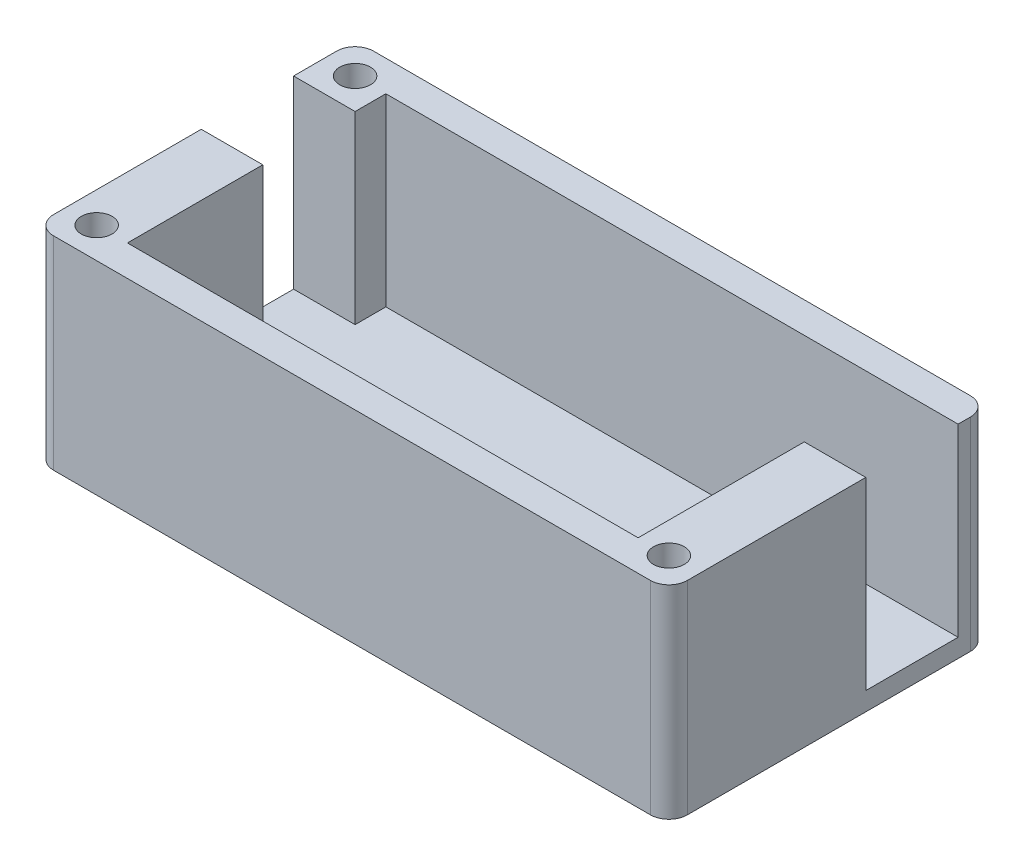
ISO-10303-21;
HEADER;
FILE_DESCRIPTION(('STEP AP214'),'2;1');
FILE_NAME('part.step','',(''),(''),'','','');
FILE_SCHEMA(('AUTOMOTIVE_DESIGN { 1 0 10303 214 1 1 1 1 }'));
ENDSEC;
DATA;
#1=APPLICATION_CONTEXT('core data for automotive mechanical design processes');
#2=APPLICATION_PROTOCOL_DEFINITION('international standard','automotive_design',2000,#1);
#3=PRODUCT_CONTEXT('',#1,'mechanical');
#4=PRODUCT('Part','Part','',(#3));
#5=PRODUCT_RELATED_PRODUCT_CATEGORY('part','',(#4));
#6=PRODUCT_DEFINITION_FORMATION('','',#4);
#7=PRODUCT_DEFINITION_CONTEXT('part definition',#1,'design');
#8=PRODUCT_DEFINITION('design','',#6,#7);
#9=PRODUCT_DEFINITION_SHAPE('','',#8);
#10=(LENGTH_UNIT() NAMED_UNIT(*) SI_UNIT(.MILLI.,.METRE.));
#11=(NAMED_UNIT(*) PLANE_ANGLE_UNIT() SI_UNIT($,.RADIAN.));
#12=(NAMED_UNIT(*) SI_UNIT($,.STERADIAN.) SOLID_ANGLE_UNIT());
#13=UNCERTAINTY_MEASURE_WITH_UNIT(LENGTH_MEASURE(1.E-05),#10,'distance_accuracy_value','');
#14=(GEOMETRIC_REPRESENTATION_CONTEXT(3) GLOBAL_UNCERTAINTY_ASSIGNED_CONTEXT((#13)) GLOBAL_UNIT_ASSIGNED_CONTEXT((#10,
#11,#12)) REPRESENTATION_CONTEXT('',''));
#15=CARTESIAN_POINT('',(0.,0.,0.));
#16=DIRECTION('',(0.,0.,1.));
#17=DIRECTION('',(1.,0.,0.));
#18=AXIS2_PLACEMENT_3D('',#15,#16,#17);
#19=CARTESIAN_POINT('',(0.,30.,0.));
#20=DIRECTION('',(0.,-1.,0.));
#21=DIRECTION('',(0.,0.,-1.));
#22=AXIS2_PLACEMENT_3D('',#19,#20,#21);
#23=PLANE('',#22);
#24=CARTESIAN_POINT('',(46.5,30.,21.));
#25=DIRECTION('',(0.,1.,0.));
#26=DIRECTION('',(0.,0.,1.));
#27=AXIS2_PLACEMENT_3D('',#24,#25,#26);
#28=CIRCLE('',#27,2.49999999999999);
#29=CARTESIAN_POINT('',(46.5,30.,23.5));
#30=VERTEX_POINT('',#29);
#31=EDGE_CURVE('E184',#30,#30,#28,.T.);
#32=ORIENTED_EDGE('',*,*,#31,.F.);
#33=EDGE_LOOP('',(#32));
#34=FACE_BOUND('',#33,.T.);
#35=DIRECTION('',(1.,0.,0.));
#36=VECTOR('',#35,1.);
#37=CARTESIAN_POINT('',(-51.5,30.,26.));
#38=LINE('',#37,#36);
#39=CARTESIAN_POINT('',(-48.5,30.,26.));
#40=VERTEX_POINT('',#39);
#41=CARTESIAN_POINT('',(48.5,30.,26.));
#42=VERTEX_POINT('',#41);
#43=EDGE_CURVE('E330',#40,#42,#38,.T.);
#44=ORIENTED_EDGE('',*,*,#43,.T.);
#45=CARTESIAN_POINT('',(48.5,30.,23.));
#46=DIRECTION('',(0.,-1.,0.));
#47=DIRECTION('',(0.,0.,-1.));
#48=AXIS2_PLACEMENT_3D('',#45,#46,#47);
#49=CIRCLE('',#48,3.);
#50=CARTESIAN_POINT('',(51.5,30.,23.));
#51=VERTEX_POINT('',#50);
#52=EDGE_CURVE('E374',#42,#51,#49,.F.);
#53=ORIENTED_EDGE('',*,*,#52,.T.);
#54=DIRECTION('',(0.,0.,-1.));
#55=VECTOR('',#54,1.);
#56=CARTESIAN_POINT('',(51.5,30.,26.));
#57=LINE('',#56,#55);
#58=CARTESIAN_POINT('',(51.5,30.,-6.));
#59=VERTEX_POINT('',#58);
#60=EDGE_CURVE('E319',#51,#59,#57,.T.);
#61=ORIENTED_EDGE('',*,*,#60,.T.);
#62=DIRECTION('',(1.,0.,0.));
#63=VECTOR('',#62,1.);
#64=CARTESIAN_POINT('',(41.5,30.,-6.));
#65=LINE('',#64,#63);
#66=CARTESIAN_POINT('',(41.5,30.,-6.));
#67=VERTEX_POINT('',#66);
#68=EDGE_CURVE('E213',#67,#59,#65,.T.);
#69=ORIENTED_EDGE('',*,*,#68,.F.);
#70=DIRECTION('',(0.,0.,-1.));
#71=VECTOR('',#70,1.);
#72=CARTESIAN_POINT('',(41.5,30.,21.));
#73=LINE('',#72,#71);
#74=CARTESIAN_POINT('',(41.5,30.,21.));
#75=VERTEX_POINT('',#74);
#76=EDGE_CURVE('E276',#75,#67,#73,.T.);
#77=ORIENTED_EDGE('',*,*,#76,.F.);
#78=DIRECTION('',(1.,0.,0.));
#79=VECTOR('',#78,1.);
#80=CARTESIAN_POINT('',(-41.5,30.,21.));
#81=LINE('',#80,#79);
#82=CARTESIAN_POINT('',(-41.5,30.,21.));
#83=VERTEX_POINT('',#82);
#84=EDGE_CURVE('E289',#83,#75,#81,.T.);
#85=ORIENTED_EDGE('',*,*,#84,.F.);
#86=DIRECTION('',(0.,0.,1.));
#87=VECTOR('',#86,1.);
#88=CARTESIAN_POINT('',(-41.5,30.,21.));
#89=LINE('',#88,#87);
#90=CARTESIAN_POINT('',(-41.5,30.,-1.));
#91=VERTEX_POINT('',#90);
#92=EDGE_CURVE('E284',#91,#83,#89,.T.);
#93=ORIENTED_EDGE('',*,*,#92,.F.);
#94=DIRECTION('',(1.,0.,0.));
#95=VECTOR('',#94,1.);
#96=CARTESIAN_POINT('',(-41.5,30.,-1.));
#97=LINE('',#96,#95);
#98=CARTESIAN_POINT('',(-51.5,30.,-1.));
#99=VERTEX_POINT('',#98);
#100=EDGE_CURVE('E242',#99,#91,#97,.T.);
#101=ORIENTED_EDGE('',*,*,#100,.F.);
#102=DIRECTION('',(0.,0.,1.));
#103=VECTOR('',#102,1.);
#104=CARTESIAN_POINT('',(-51.5,30.,26.));
#105=LINE('',#104,#103);
#106=CARTESIAN_POINT('',(-51.5,30.,23.));
#107=VERTEX_POINT('',#106);
#108=EDGE_CURVE('E326',#99,#107,#105,.T.);
#109=ORIENTED_EDGE('',*,*,#108,.T.);
#110=CARTESIAN_POINT('',(-48.5,30.,23.));
#111=DIRECTION('',(0.,-1.,0.));
#112=DIRECTION('',(0.,0.,-1.));
#113=AXIS2_PLACEMENT_3D('',#110,#111,#112);
#114=CIRCLE('',#113,3.);
#115=EDGE_CURVE('E371',#107,#40,#114,.F.);
#116=ORIENTED_EDGE('',*,*,#115,.T.);
#117=EDGE_LOOP('',(#44,#53,#61,#69,#77,#85,#93,#101,#109,#116));
#118=FACE_BOUND('',#117,.T.);
#119=CARTESIAN_POINT('',(-46.5,30.,21.));
#120=DIRECTION('',(0.,1.,0.));
#121=DIRECTION('',(0.,0.,1.));
#122=AXIS2_PLACEMENT_3D('',#119,#120,#121);
#123=CIRCLE('',#122,2.49999999999999);
#124=CARTESIAN_POINT('',(-46.5,30.,23.5));
#125=VERTEX_POINT('',#124);
#126=EDGE_CURVE('E198',#125,#125,#123,.T.);
#127=ORIENTED_EDGE('',*,*,#126,.F.);
#128=EDGE_LOOP('',(#127));
#129=FACE_BOUND('',#128,.T.);
#130=ADVANCED_FACE('F38',(#34,#118,#129),#23,.F.);
#131=CARTESIAN_POINT('',(-46.5,30.,-21.));
#132=DIRECTION('',(0.,1.,0.));
#133=DIRECTION('',(0.,0.,1.));
#134=AXIS2_PLACEMENT_3D('',#131,#132,#133);
#135=CIRCLE('',#134,2.49999999999999);
#136=CARTESIAN_POINT('',(-46.5,30.,-18.5));
#137=VERTEX_POINT('',#136);
#138=EDGE_CURVE('E185',#137,#137,#135,.T.);
#139=ORIENTED_EDGE('',*,*,#138,.F.);
#140=EDGE_LOOP('',(#139));
#141=FACE_BOUND('',#140,.T.);
#142=CARTESIAN_POINT('',(51.5,30.,-21.));
#143=VERTEX_POINT('',#142);
#144=CARTESIAN_POINT('',(51.5,30.,-23.));
#145=VERTEX_POINT('',#144);
#146=EDGE_CURVE('E318',#143,#145,#57,.T.);
#147=ORIENTED_EDGE('',*,*,#146,.T.);
#148=CARTESIAN_POINT('',(48.5,30.,-23.));
#149=DIRECTION('',(0.,-1.,0.));
#150=DIRECTION('',(0.,0.,-1.));
#151=AXIS2_PLACEMENT_3D('',#148,#149,#150);
#152=CIRCLE('',#151,3.);
#153=CARTESIAN_POINT('',(48.5,30.,-26.));
#154=VERTEX_POINT('',#153);
#155=EDGE_CURVE('E362',#145,#154,#152,.F.);
#156=ORIENTED_EDGE('',*,*,#155,.T.);
#157=DIRECTION('',(-1.,0.,0.));
#158=VECTOR('',#157,1.);
#159=CARTESIAN_POINT('',(-51.5,30.,-26.));
#160=LINE('',#159,#158);
#161=CARTESIAN_POINT('',(-48.5,30.,-26.));
#162=VERTEX_POINT('',#161);
#163=EDGE_CURVE('E322',#154,#162,#160,.T.);
#164=ORIENTED_EDGE('',*,*,#163,.T.);
#165=CARTESIAN_POINT('',(-48.5,30.,-23.));
#166=DIRECTION('',(0.,-1.,0.));
#167=DIRECTION('',(0.,0.,-1.));
#168=AXIS2_PLACEMENT_3D('',#165,#166,#167);
#169=CIRCLE('',#168,3.);
#170=CARTESIAN_POINT('',(-51.5,30.,-23.));
#171=VERTEX_POINT('',#170);
#172=EDGE_CURVE('E359',#162,#171,#169,.F.);
#173=ORIENTED_EDGE('',*,*,#172,.T.);
#174=CARTESIAN_POINT('',(-51.5,30.,-16.));
#175=VERTEX_POINT('',#174);
#176=EDGE_CURVE('E327',#171,#175,#105,.T.);
#177=ORIENTED_EDGE('',*,*,#176,.T.);
#178=DIRECTION('',(-1.,0.,0.));
#179=VECTOR('',#178,1.);
#180=CARTESIAN_POINT('',(-41.5,30.,-16.));
#181=LINE('',#180,#179);
#182=CARTESIAN_POINT('',(-41.5,30.,-16.));
#183=VERTEX_POINT('',#182);
#184=EDGE_CURVE('E206',#183,#175,#181,.T.);
#185=ORIENTED_EDGE('',*,*,#184,.F.);
#186=CARTESIAN_POINT('',(-41.5,30.,-21.));
#187=VERTEX_POINT('',#186);
#188=EDGE_CURVE('E285',#187,#183,#89,.T.);
#189=ORIENTED_EDGE('',*,*,#188,.F.);
#190=DIRECTION('',(-1.,0.,0.));
#191=VECTOR('',#190,1.);
#192=CARTESIAN_POINT('',(-41.5,30.,-21.));
#193=LINE('',#192,#191);
#194=EDGE_CURVE('E280',#143,#187,#193,.T.);
#195=ORIENTED_EDGE('',*,*,#194,.F.);
#196=EDGE_LOOP('',(#147,#156,#164,#173,#177,#185,#189,#195));
#197=FACE_BOUND('',#196,.T.);
#198=ADVANCED_FACE('F412',(#141,#197),#23,.F.);
#199=CARTESIAN_POINT('',(-41.5,30.,21.));
#200=DIRECTION('',(1.,0.,0.));
#201=DIRECTION('',(0.,0.,-1.));
#202=AXIS2_PLACEMENT_3D('',#199,#200,#201);
#203=PLANE('',#202);
#204=DIRECTION('',(0.,1.,0.));
#205=VECTOR('',#204,1.);
#206=CARTESIAN_POINT('',(-41.5,-18.0277563773199,-1.));
#207=LINE('',#206,#205);
#208=CARTESIAN_POINT('',(-41.5,0.,-0.999999999999994));
#209=VERTEX_POINT('',#208);
#210=EDGE_CURVE('E236',#209,#91,#207,.T.);
#211=ORIENTED_EDGE('',*,*,#210,.T.);
#212=ORIENTED_EDGE('',*,*,#92,.T.);
#213=DIRECTION('',(0.,-1.,0.));
#214=VECTOR('',#213,1.);
#215=CARTESIAN_POINT('',(-41.5,30.,21.));
#216=LINE('',#215,#214);
#217=CARTESIAN_POINT('',(-41.5,0.,21.));
#218=VERTEX_POINT('',#217);
#219=EDGE_CURVE('E311',#83,#218,#216,.T.);
#220=ORIENTED_EDGE('',*,*,#219,.T.);
#221=DIRECTION('',(0.,0.,1.));
#222=VECTOR('',#221,1.);
#223=CARTESIAN_POINT('',(-41.5,0.,21.));
#224=LINE('',#223,#222);
#225=EDGE_CURVE('E300',#209,#218,#224,.T.);
#226=ORIENTED_EDGE('',*,*,#225,.F.);
#227=EDGE_LOOP('',(#211,#212,#220,#226));
#228=FACE_BOUND('',#227,.T.);
#229=ADVANCED_FACE('F424',(#228),#203,.T.);
#230=CARTESIAN_POINT('',(51.5,30.,26.));
#231=DIRECTION('',(-1.,0.,0.));
#232=DIRECTION('',(0.,0.,1.));
#233=AXIS2_PLACEMENT_3D('',#230,#231,#232);
#234=PLANE('',#233);
#235=DIRECTION('',(0.,0.,1.));
#236=VECTOR('',#235,1.);
#237=CARTESIAN_POINT('',(51.5,-3.,26.));
#238=LINE('',#237,#236);
#239=CARTESIAN_POINT('',(51.5,-3.,-23.));
#240=VERTEX_POINT('',#239);
#241=CARTESIAN_POINT('',(51.5,-3.,23.));
#242=VERTEX_POINT('',#241);
#243=EDGE_CURVE('E271',#240,#242,#238,.T.);
#244=ORIENTED_EDGE('',*,*,#243,.F.);
#245=DIRECTION('',(0.,-1.,0.));
#246=VECTOR('',#245,1.);
#247=CARTESIAN_POINT('',(51.5,30.,-23.));
#248=LINE('',#247,#246);
#249=EDGE_CURVE('E356',#240,#145,#248,.F.);
#250=ORIENTED_EDGE('',*,*,#249,.T.);
#251=ORIENTED_EDGE('',*,*,#146,.F.);
#252=DIRECTION('',(0.,1.,0.));
#253=VECTOR('',#252,1.);
#254=CARTESIAN_POINT('',(51.5,-18.0277563773199,-21.));
#255=LINE('',#254,#253);
#256=CARTESIAN_POINT('',(51.5,0.,-21.));
#257=VERTEX_POINT('',#256);
#258=EDGE_CURVE('E212',#257,#143,#255,.T.);
#259=ORIENTED_EDGE('',*,*,#258,.F.);
#260=DIRECTION('',(0.,0.,1.));
#261=VECTOR('',#260,1.);
#262=CARTESIAN_POINT('',(51.5,0.,-21.));
#263=LINE('',#262,#261);
#264=CARTESIAN_POINT('',(51.5,0.,-6.));
#265=VERTEX_POINT('',#264);
#266=EDGE_CURVE('E207',#257,#265,#263,.T.);
#267=ORIENTED_EDGE('',*,*,#266,.T.);
#268=DIRECTION('',(0.,1.,0.));
#269=VECTOR('',#268,1.);
#270=CARTESIAN_POINT('',(51.5,-18.0277563773199,-6.));
#271=LINE('',#270,#269);
#272=EDGE_CURVE('E222',#265,#59,#271,.T.);
#273=ORIENTED_EDGE('',*,*,#272,.T.);
#274=ORIENTED_EDGE('',*,*,#60,.F.);
#275=DIRECTION('',(0.,-1.,0.));
#276=VECTOR('',#275,1.);
#277=CARTESIAN_POINT('',(51.5,30.,23.));
#278=LINE('',#277,#276);
#279=EDGE_CURVE('E352',#51,#242,#278,.T.);
#280=ORIENTED_EDGE('',*,*,#279,.T.);
#281=EDGE_LOOP('',(#244,#250,#251,#259,#267,#273,#274,#280));
#282=FACE_BOUND('',#281,.T.);
#283=ADVANCED_FACE('F400',(#282),#234,.F.);
#284=CARTESIAN_POINT('',(-51.5,30.,-26.));
#285=DIRECTION('',(0.,0.,1.));
#286=DIRECTION('',(1.,0.,0.));
#287=AXIS2_PLACEMENT_3D('',#284,#285,#286);
#288=PLANE('',#287);
#289=ORIENTED_EDGE('',*,*,#163,.F.);
#290=DIRECTION('',(0.,-1.,0.));
#291=VECTOR('',#290,1.);
#292=CARTESIAN_POINT('',(48.5,30.,-26.));
#293=LINE('',#292,#291);
#294=CARTESIAN_POINT('',(48.5,-3.,-26.));
#295=VERTEX_POINT('',#294);
#296=EDGE_CURVE('E336',#154,#295,#293,.T.);
#297=ORIENTED_EDGE('',*,*,#296,.T.);
#298=DIRECTION('',(1.,0.,0.));
#299=VECTOR('',#298,1.);
#300=CARTESIAN_POINT('',(51.5,-3.,-26.));
#301=LINE('',#300,#299);
#302=CARTESIAN_POINT('',(-48.5,-3.,-26.));
#303=VERTEX_POINT('',#302);
#304=EDGE_CURVE('E267',#303,#295,#301,.T.);
#305=ORIENTED_EDGE('',*,*,#304,.F.);
#306=DIRECTION('',(0.,-1.,0.));
#307=VECTOR('',#306,1.);
#308=CARTESIAN_POINT('',(-48.5,30.,-26.));
#309=LINE('',#308,#307);
#310=EDGE_CURVE('E333',#303,#162,#309,.F.);
#311=ORIENTED_EDGE('',*,*,#310,.T.);
#312=EDGE_LOOP('',(#289,#297,#305,#311));
#313=FACE_BOUND('',#312,.T.);
#314=ADVANCED_FACE('F408',(#313),#288,.F.);
#315=CARTESIAN_POINT('',(-51.5,30.,26.));
#316=DIRECTION('',(1.,0.,0.));
#317=DIRECTION('',(0.,0.,-1.));
#318=AXIS2_PLACEMENT_3D('',#315,#316,#317);
#319=PLANE('',#318);
#320=DIRECTION('',(0.,0.,-1.));
#321=VECTOR('',#320,1.);
#322=CARTESIAN_POINT('',(-51.5,-3.,-26.));
#323=LINE('',#322,#321);
#324=CARTESIAN_POINT('',(-51.5,-3.,23.));
#325=VERTEX_POINT('',#324);
#326=CARTESIAN_POINT('',(-51.5,-3.,-23.));
#327=VERTEX_POINT('',#326);
#328=EDGE_CURVE('E263',#325,#327,#323,.T.);
#329=ORIENTED_EDGE('',*,*,#328,.F.);
#330=DIRECTION('',(0.,-1.,0.));
#331=VECTOR('',#330,1.);
#332=CARTESIAN_POINT('',(-51.5,30.,23.));
#333=LINE('',#332,#331);
#334=EDGE_CURVE('E11',#325,#107,#333,.F.);
#335=ORIENTED_EDGE('',*,*,#334,.T.);
#336=ORIENTED_EDGE('',*,*,#108,.F.);
#337=DIRECTION('',(0.,1.,0.));
#338=VECTOR('',#337,1.);
#339=CARTESIAN_POINT('',(-51.5,-18.0277563773199,-1.));
#340=LINE('',#339,#338);
#341=CARTESIAN_POINT('',(-51.5,0.,-1.));
#342=VERTEX_POINT('',#341);
#343=EDGE_CURVE('E249',#342,#99,#340,.T.);
#344=ORIENTED_EDGE('',*,*,#343,.F.);
#345=DIRECTION('',(0.,0.,-1.));
#346=VECTOR('',#345,1.);
#347=CARTESIAN_POINT('',(-51.5,0.,-1.));
#348=LINE('',#347,#346);
#349=CARTESIAN_POINT('',(-51.5,0.,-16.));
#350=VERTEX_POINT('',#349);
#351=EDGE_CURVE('E231',#342,#350,#348,.T.);
#352=ORIENTED_EDGE('',*,*,#351,.T.);
#353=DIRECTION('',(0.,1.,0.));
#354=VECTOR('',#353,1.);
#355=CARTESIAN_POINT('',(-51.5,-18.0277563773199,-16.));
#356=LINE('',#355,#354);
#357=EDGE_CURVE('E252',#350,#175,#356,.T.);
#358=ORIENTED_EDGE('',*,*,#357,.T.);
#359=ORIENTED_EDGE('',*,*,#176,.F.);
#360=DIRECTION('',(0.,-1.,0.));
#361=VECTOR('',#360,1.);
#362=CARTESIAN_POINT('',(-51.5,30.,-23.));
#363=LINE('',#362,#361);
#364=EDGE_CURVE('E47',#171,#327,#363,.T.);
#365=ORIENTED_EDGE('',*,*,#364,.T.);
#366=EDGE_LOOP('',(#329,#335,#336,#344,#352,#358,#359,#365));
#367=FACE_BOUND('',#366,.T.);
#368=ADVANCED_FACE('F380',(#367),#319,.F.);
#369=CARTESIAN_POINT('',(-51.5,30.,26.));
#370=DIRECTION('',(0.,0.,-1.));
#371=DIRECTION('',(-1.,0.,0.));
#372=AXIS2_PLACEMENT_3D('',#369,#370,#371);
#373=PLANE('',#372);
#374=DIRECTION('',(-1.,0.,0.));
#375=VECTOR('',#374,1.);
#376=CARTESIAN_POINT('',(-51.5,-3.,26.));
#377=LINE('',#376,#375);
#378=CARTESIAN_POINT('',(48.5,-3.,26.));
#379=VERTEX_POINT('',#378);
#380=CARTESIAN_POINT('',(-48.5,-3.,26.));
#381=VERTEX_POINT('',#380);
#382=EDGE_CURVE('E230',#379,#381,#377,.T.);
#383=ORIENTED_EDGE('',*,*,#382,.F.);
#384=DIRECTION('',(0.,-1.,0.));
#385=VECTOR('',#384,1.);
#386=CARTESIAN_POINT('',(48.5,30.,26.));
#387=LINE('',#386,#385);
#388=EDGE_CURVE('E60',#379,#42,#387,.F.);
#389=ORIENTED_EDGE('',*,*,#388,.T.);
#390=ORIENTED_EDGE('',*,*,#43,.F.);
#391=DIRECTION('',(0.,-1.,0.));
#392=VECTOR('',#391,1.);
#393=CARTESIAN_POINT('',(-48.5,30.,26.));
#394=LINE('',#393,#392);
#395=EDGE_CURVE('E365',#40,#381,#394,.T.);
#396=ORIENTED_EDGE('',*,*,#395,.T.);
#397=EDGE_LOOP('',(#383,#389,#390,#396));
#398=FACE_BOUND('',#397,.T.);
#399=ADVANCED_FACE('F390',(#398),#373,.F.);
#400=CARTESIAN_POINT('',(41.5,30.,21.));
#401=DIRECTION('',(-1.,0.,0.));
#402=DIRECTION('',(0.,0.,1.));
#403=AXIS2_PLACEMENT_3D('',#400,#401,#402);
#404=PLANE('',#403);
#405=DIRECTION('',(0.,1.,0.));
#406=VECTOR('',#405,1.);
#407=CARTESIAN_POINT('',(41.5,-18.0277563773199,-6.));
#408=LINE('',#407,#406);
#409=CARTESIAN_POINT('',(41.5,0.,-6.));
#410=VERTEX_POINT('',#409);
#411=EDGE_CURVE('E217',#410,#67,#408,.T.);
#412=ORIENTED_EDGE('',*,*,#411,.F.);
#413=DIRECTION('',(0.,0.,-1.));
#414=VECTOR('',#413,1.);
#415=CARTESIAN_POINT('',(41.5,0.,21.));
#416=LINE('',#415,#414);
#417=CARTESIAN_POINT('',(41.5,0.,21.));
#418=VERTEX_POINT('',#417);
#419=EDGE_CURVE('E275',#418,#410,#416,.T.);
#420=ORIENTED_EDGE('',*,*,#419,.F.);
#421=DIRECTION('',(0.,-1.,0.));
#422=VECTOR('',#421,1.);
#423=CARTESIAN_POINT('',(41.5,30.,21.));
#424=LINE('',#423,#422);
#425=EDGE_CURVE('E292',#75,#418,#424,.T.);
#426=ORIENTED_EDGE('',*,*,#425,.F.);
#427=ORIENTED_EDGE('',*,*,#76,.T.);
#428=EDGE_LOOP('',(#412,#420,#426,#427));
#429=FACE_BOUND('',#428,.T.);
#430=ADVANCED_FACE('F429',(#429),#404,.T.);
#431=CARTESIAN_POINT('',(-41.5,30.,-21.));
#432=DIRECTION('',(0.,0.,1.));
#433=DIRECTION('',(1.,0.,0.));
#434=AXIS2_PLACEMENT_3D('',#431,#432,#433);
#435=PLANE('',#434);
#436=DIRECTION('',(-1.,0.,0.));
#437=VECTOR('',#436,1.);
#438=CARTESIAN_POINT('',(-41.5,0.,-21.));
#439=LINE('',#438,#437);
#440=CARTESIAN_POINT('',(-41.5,0.,-21.));
#441=VERTEX_POINT('',#440);
#442=EDGE_CURVE('E296',#257,#441,#439,.T.);
#443=ORIENTED_EDGE('',*,*,#442,.F.);
#444=ORIENTED_EDGE('',*,*,#258,.T.);
#445=ORIENTED_EDGE('',*,*,#194,.T.);
#446=DIRECTION('',(0.,-1.,0.));
#447=VECTOR('',#446,1.);
#448=CARTESIAN_POINT('',(-41.5,30.,-21.));
#449=LINE('',#448,#447);
#450=EDGE_CURVE('E315',#187,#441,#449,.T.);
#451=ORIENTED_EDGE('',*,*,#450,.T.);
#452=EDGE_LOOP('',(#443,#444,#445,#451));
#453=FACE_BOUND('',#452,.T.);
#454=ADVANCED_FACE('F559',(#453),#435,.T.);
#455=DIRECTION('',(0.,1.,0.));
#456=VECTOR('',#455,1.);
#457=CARTESIAN_POINT('',(-41.5,-18.0277563773199,-16.));
#458=LINE('',#457,#456);
#459=CARTESIAN_POINT('',(-41.5,0.,-16.));
#460=VERTEX_POINT('',#459);
#461=EDGE_CURVE('E245',#460,#183,#458,.T.);
#462=ORIENTED_EDGE('',*,*,#461,.F.);
#463=EDGE_CURVE('E301',#441,#460,#224,.T.);
#464=ORIENTED_EDGE('',*,*,#463,.F.);
#465=ORIENTED_EDGE('',*,*,#450,.F.);
#466=ORIENTED_EDGE('',*,*,#188,.T.);
#467=EDGE_LOOP('',(#462,#464,#465,#466));
#468=FACE_BOUND('',#467,.T.);
#469=ADVANCED_FACE('F566',(#468),#203,.T.);
#470=CARTESIAN_POINT('',(-41.5,30.,21.));
#471=DIRECTION('',(0.,0.,-1.));
#472=DIRECTION('',(-1.,0.,0.));
#473=AXIS2_PLACEMENT_3D('',#470,#471,#472);
#474=PLANE('',#473);
#475=DIRECTION('',(1.,0.,0.));
#476=VECTOR('',#475,1.);
#477=CARTESIAN_POINT('',(-41.5,0.,21.));
#478=LINE('',#477,#476);
#479=EDGE_CURVE('E281',#218,#418,#478,.T.);
#480=ORIENTED_EDGE('',*,*,#479,.F.);
#481=ORIENTED_EDGE('',*,*,#219,.F.);
#482=ORIENTED_EDGE('',*,*,#84,.T.);
#483=ORIENTED_EDGE('',*,*,#425,.T.);
#484=EDGE_LOOP('',(#480,#481,#482,#483));
#485=FACE_BOUND('',#484,.T.);
#486=ADVANCED_FACE('F550',(#485),#474,.T.);
#487=CARTESIAN_POINT('',(0.,0.,0.));
#488=DIRECTION('',(0.,1.,0.));
#489=DIRECTION('',(0.,0.,1.));
#490=AXIS2_PLACEMENT_3D('',#487,#488,#489);
#491=PLANE('',#490);
#492=ORIENTED_EDGE('',*,*,#463,.T.);
#493=DIRECTION('',(1.,0.,0.));
#494=VECTOR('',#493,1.);
#495=CARTESIAN_POINT('',(-41.5,0.,-16.));
#496=LINE('',#495,#494);
#497=EDGE_CURVE('E218',#350,#460,#496,.T.);
#498=ORIENTED_EDGE('',*,*,#497,.F.);
#499=ORIENTED_EDGE('',*,*,#351,.F.);
#500=DIRECTION('',(-1.,0.,0.));
#501=VECTOR('',#500,1.);
#502=CARTESIAN_POINT('',(-41.5,0.,-1.));
#503=LINE('',#502,#501);
#504=EDGE_CURVE('E235',#209,#342,#503,.T.);
#505=ORIENTED_EDGE('',*,*,#504,.F.);
#506=ORIENTED_EDGE('',*,*,#225,.T.);
#507=ORIENTED_EDGE('',*,*,#479,.T.);
#508=ORIENTED_EDGE('',*,*,#419,.T.);
#509=DIRECTION('',(-1.,0.,0.));
#510=VECTOR('',#509,1.);
#511=CARTESIAN_POINT('',(41.5,0.,-6.));
#512=LINE('',#511,#510);
#513=EDGE_CURVE('E211',#265,#410,#512,.T.);
#514=ORIENTED_EDGE('',*,*,#513,.F.);
#515=ORIENTED_EDGE('',*,*,#266,.F.);
#516=ORIENTED_EDGE('',*,*,#442,.T.);
#517=EDGE_LOOP('',(#492,#498,#499,#505,#506,#507,#508,#514,#515,#516));
#518=FACE_BOUND('',#517,.T.);
#519=ADVANCED_FACE('F544',(#518),#491,.T.);
#520=CARTESIAN_POINT('',(0.,-3.,0.));
#521=DIRECTION('',(0.,1.,0.));
#522=DIRECTION('',(0.,0.,1.));
#523=AXIS2_PLACEMENT_3D('',#520,#521,#522);
#524=PLANE('',#523);
#525=ORIENTED_EDGE('',*,*,#304,.T.);
#526=CARTESIAN_POINT('',(48.5,-3.,-23.));
#527=DIRECTION('',(0.,1.,0.));
#528=DIRECTION('',(0.,0.,1.));
#529=AXIS2_PLACEMENT_3D('',#526,#527,#528);
#530=CIRCLE('',#529,3.);
#531=EDGE_CURVE('E349',#295,#240,#530,.F.);
#532=ORIENTED_EDGE('',*,*,#531,.T.);
#533=ORIENTED_EDGE('',*,*,#243,.T.);
#534=CARTESIAN_POINT('',(48.5,-3.,23.));
#535=DIRECTION('',(0.,1.,0.));
#536=DIRECTION('',(0.,0.,1.));
#537=AXIS2_PLACEMENT_3D('',#534,#535,#536);
#538=CIRCLE('',#537,3.);
#539=EDGE_CURVE('E346',#242,#379,#538,.F.);
#540=ORIENTED_EDGE('',*,*,#539,.T.);
#541=ORIENTED_EDGE('',*,*,#382,.T.);
#542=CARTESIAN_POINT('',(-48.5,-3.,23.));
#543=DIRECTION('',(0.,1.,0.));
#544=DIRECTION('',(0.,0.,1.));
#545=AXIS2_PLACEMENT_3D('',#542,#543,#544);
#546=CIRCLE('',#545,3.);
#547=EDGE_CURVE('E343',#381,#325,#546,.F.);
#548=ORIENTED_EDGE('',*,*,#547,.T.);
#549=ORIENTED_EDGE('',*,*,#328,.T.);
#550=CARTESIAN_POINT('',(-48.5,-3.,-23.));
#551=DIRECTION('',(0.,1.,0.));
#552=DIRECTION('',(0.,0.,1.));
#553=AXIS2_PLACEMENT_3D('',#550,#551,#552);
#554=CIRCLE('',#553,3.);
#555=EDGE_CURVE('E340',#327,#303,#554,.F.);
#556=ORIENTED_EDGE('',*,*,#555,.T.);
#557=EDGE_LOOP('',(#525,#532,#533,#540,#541,#548,#549,#556));
#558=FACE_BOUND('',#557,.T.);
#559=ADVANCED_FACE('F384',(#558),#524,.F.);
#560=CARTESIAN_POINT('',(-41.5,-18.0277563773199,-1.));
#561=DIRECTION('',(0.,0.,1.));
#562=DIRECTION('',(1.,0.,0.));
#563=AXIS2_PLACEMENT_3D('',#560,#561,#562);
#564=PLANE('',#563);
#565=ORIENTED_EDGE('',*,*,#504,.T.);
#566=ORIENTED_EDGE('',*,*,#343,.T.);
#567=ORIENTED_EDGE('',*,*,#100,.T.);
#568=ORIENTED_EDGE('',*,*,#210,.F.);
#569=EDGE_LOOP('',(#565,#566,#567,#568));
#570=FACE_BOUND('',#569,.T.);
#571=ADVANCED_FACE('F531',(#570),#564,.F.);
#572=CARTESIAN_POINT('',(-41.5,-18.0277563773199,-16.));
#573=DIRECTION('',(0.,0.,-1.));
#574=DIRECTION('',(-1.,0.,0.));
#575=AXIS2_PLACEMENT_3D('',#572,#573,#574);
#576=PLANE('',#575);
#577=ORIENTED_EDGE('',*,*,#497,.T.);
#578=ORIENTED_EDGE('',*,*,#461,.T.);
#579=ORIENTED_EDGE('',*,*,#184,.T.);
#580=ORIENTED_EDGE('',*,*,#357,.F.);
#581=EDGE_LOOP('',(#577,#578,#579,#580));
#582=FACE_BOUND('',#581,.T.);
#583=ADVANCED_FACE('F522',(#582),#576,.F.);
#584=CARTESIAN_POINT('',(41.5,-18.0277563773199,-6.));
#585=DIRECTION('',(0.,0.,1.));
#586=DIRECTION('',(1.,0.,0.));
#587=AXIS2_PLACEMENT_3D('',#584,#585,#586);
#588=PLANE('',#587);
#589=ORIENTED_EDGE('',*,*,#513,.T.);
#590=ORIENTED_EDGE('',*,*,#411,.T.);
#591=ORIENTED_EDGE('',*,*,#68,.T.);
#592=ORIENTED_EDGE('',*,*,#272,.F.);
#593=EDGE_LOOP('',(#589,#590,#591,#592));
#594=FACE_BOUND('',#593,.T.);
#595=ADVANCED_FACE('F508',(#594),#588,.F.);
#596=CARTESIAN_POINT('',(-46.5,20.,21.));
#597=DIRECTION('',(0.,1.,0.));
#598=DIRECTION('',(0.,0.,1.));
#599=AXIS2_PLACEMENT_3D('',#596,#597,#598);
#600=CONICAL_SURFACE('',#599,2.5,1.02974425867665);
#601=CARTESIAN_POINT('',(-46.5,18.4978484524311,21.));
#602=VERTEX_POINT('',#601);
#603=VERTEX_LOOP('',#602);
#604=FACE_BOUND('',#603,.T.);
#605=CARTESIAN_POINT('',(-46.5,20.,21.));
#606=DIRECTION('',(0.,1.,0.));
#607=DIRECTION('',(0.,0.,1.));
#608=AXIS2_PLACEMENT_3D('',#605,#606,#607);
#609=CIRCLE('',#608,2.5);
#610=CARTESIAN_POINT('',(-46.5,20.,23.5));
#611=VERTEX_POINT('',#610);
#612=EDGE_CURVE('E202',#611,#611,#609,.T.);
#613=ORIENTED_EDGE('',*,*,#612,.T.);
#614=EDGE_LOOP('',(#613));
#615=FACE_BOUND('',#614,.T.);
#616=ADVANCED_FACE('F500',(#604,#615),#600,.F.);
#617=CARTESIAN_POINT('',(-46.5,30.,21.));
#618=DIRECTION('',(0.,1.,0.));
#619=DIRECTION('',(0.,0.,1.));
#620=AXIS2_PLACEMENT_3D('',#617,#618,#619);
#621=CYLINDRICAL_SURFACE('',#620,2.49999999999999);
#622=ORIENTED_EDGE('',*,*,#612,.F.);
#623=EDGE_LOOP('',(#622));
#624=FACE_BOUND('',#623,.T.);
#625=ORIENTED_EDGE('',*,*,#126,.T.);
#626=EDGE_LOOP('',(#625));
#627=FACE_BOUND('',#626,.T.);
#628=ADVANCED_FACE('F491',(#624,#627),#621,.F.);
#629=CARTESIAN_POINT('',(46.5,20.,21.));
#630=DIRECTION('',(0.,1.,0.));
#631=DIRECTION('',(0.,0.,1.));
#632=AXIS2_PLACEMENT_3D('',#629,#630,#631);
#633=CONICAL_SURFACE('',#632,2.5,1.02974425867665);
#634=CARTESIAN_POINT('',(46.5,18.4978484524311,21.));
#635=VERTEX_POINT('',#634);
#636=VERTEX_LOOP('',#635);
#637=FACE_BOUND('',#636,.T.);
#638=CARTESIAN_POINT('',(46.5,20.,21.));
#639=DIRECTION('',(0.,1.,0.));
#640=DIRECTION('',(0.,0.,1.));
#641=AXIS2_PLACEMENT_3D('',#638,#639,#640);
#642=CIRCLE('',#641,2.5);
#643=CARTESIAN_POINT('',(46.5,20.,23.5));
#644=VERTEX_POINT('',#643);
#645=EDGE_CURVE('E190',#644,#644,#642,.T.);
#646=ORIENTED_EDGE('',*,*,#645,.T.);
#647=EDGE_LOOP('',(#646));
#648=FACE_BOUND('',#647,.T.);
#649=ADVANCED_FACE('F482',(#637,#648),#633,.F.);
#650=CARTESIAN_POINT('',(46.5,30.,21.));
#651=DIRECTION('',(0.,1.,0.));
#652=DIRECTION('',(0.,0.,1.));
#653=AXIS2_PLACEMENT_3D('',#650,#651,#652);
#654=CYLINDRICAL_SURFACE('',#653,2.49999999999999);
#655=ORIENTED_EDGE('',*,*,#645,.F.);
#656=EDGE_LOOP('',(#655));
#657=FACE_BOUND('',#656,.T.);
#658=ORIENTED_EDGE('',*,*,#31,.T.);
#659=EDGE_LOOP('',(#658));
#660=FACE_BOUND('',#659,.T.);
#661=ADVANCED_FACE('F177',(#657,#660),#654,.F.);
#662=CARTESIAN_POINT('',(-46.5,20.,-21.));
#663=DIRECTION('',(0.,1.,0.));
#664=DIRECTION('',(0.,0.,1.));
#665=AXIS2_PLACEMENT_3D('',#662,#663,#664);
#666=CONICAL_SURFACE('',#665,2.5,1.02974425867665);
#667=CARTESIAN_POINT('',(-46.5,18.4978484524311,-21.));
#668=VERTEX_POINT('',#667);
#669=VERTEX_LOOP('',#668);
#670=FACE_BOUND('',#669,.T.);
#671=CARTESIAN_POINT('',(-46.5,20.,-21.));
#672=DIRECTION('',(0.,1.,0.));
#673=DIRECTION('',(0.,0.,1.));
#674=AXIS2_PLACEMENT_3D('',#671,#672,#673);
#675=CIRCLE('',#674,2.5);
#676=CARTESIAN_POINT('',(-46.5,20.,-18.5));
#677=VERTEX_POINT('',#676);
#678=EDGE_CURVE('E181',#677,#677,#675,.T.);
#679=ORIENTED_EDGE('',*,*,#678,.T.);
#680=EDGE_LOOP('',(#679));
#681=FACE_BOUND('',#680,.T.);
#682=ADVANCED_FACE('F173',(#670,#681),#666,.F.);
#683=CARTESIAN_POINT('',(-46.5,30.,-21.));
#684=DIRECTION('',(0.,1.,0.));
#685=DIRECTION('',(0.,0.,1.));
#686=AXIS2_PLACEMENT_3D('',#683,#684,#685);
#687=CYLINDRICAL_SURFACE('',#686,2.49999999999999);
#688=ORIENTED_EDGE('',*,*,#678,.F.);
#689=EDGE_LOOP('',(#688));
#690=FACE_BOUND('',#689,.T.);
#691=ORIENTED_EDGE('',*,*,#138,.T.);
#692=EDGE_LOOP('',(#691));
#693=FACE_BOUND('',#692,.T.);
#694=ADVANCED_FACE('F176',(#690,#693),#687,.F.);
#695=CARTESIAN_POINT('',(48.5,30.,-23.));
#696=DIRECTION('',(0.,-1.,0.));
#697=DIRECTION('',(0.,0.,-1.));
#698=AXIS2_PLACEMENT_3D('',#695,#696,#697);
#699=CYLINDRICAL_SURFACE('',#698,3.);
#700=ORIENTED_EDGE('',*,*,#155,.F.);
#701=ORIENTED_EDGE('',*,*,#249,.F.);
#702=ORIENTED_EDGE('',*,*,#531,.F.);
#703=ORIENTED_EDGE('',*,*,#296,.F.);
#704=EDGE_LOOP('',(#700,#701,#702,#703));
#705=FACE_BOUND('',#704,.T.);
#706=ADVANCED_FACE('F405',(#705),#699,.T.);
#707=CARTESIAN_POINT('',(48.5,30.,23.));
#708=DIRECTION('',(0.,-1.,0.));
#709=DIRECTION('',(0.,0.,-1.));
#710=AXIS2_PLACEMENT_3D('',#707,#708,#709);
#711=CYLINDRICAL_SURFACE('',#710,3.);
#712=ORIENTED_EDGE('',*,*,#52,.F.);
#713=ORIENTED_EDGE('',*,*,#388,.F.);
#714=ORIENTED_EDGE('',*,*,#539,.F.);
#715=ORIENTED_EDGE('',*,*,#279,.F.);
#716=EDGE_LOOP('',(#712,#713,#714,#715));
#717=FACE_BOUND('',#716,.T.);
#718=ADVANCED_FACE('F397',(#717),#711,.T.);
#719=CARTESIAN_POINT('',(-48.5,30.,23.));
#720=DIRECTION('',(0.,-1.,0.));
#721=DIRECTION('',(0.,0.,-1.));
#722=AXIS2_PLACEMENT_3D('',#719,#720,#721);
#723=CYLINDRICAL_SURFACE('',#722,3.);
#724=ORIENTED_EDGE('',*,*,#115,.F.);
#725=ORIENTED_EDGE('',*,*,#334,.F.);
#726=ORIENTED_EDGE('',*,*,#547,.F.);
#727=ORIENTED_EDGE('',*,*,#395,.F.);
#728=EDGE_LOOP('',(#724,#725,#726,#727));
#729=FACE_BOUND('',#728,.T.);
#730=ADVANCED_FACE('F389',(#729),#723,.T.);
#731=CARTESIAN_POINT('',(-48.5,30.,-23.));
#732=DIRECTION('',(0.,-1.,0.));
#733=DIRECTION('',(0.,0.,-1.));
#734=AXIS2_PLACEMENT_3D('',#731,#732,#733);
#735=CYLINDRICAL_SURFACE('',#734,3.);
#736=ORIENTED_EDGE('',*,*,#172,.F.);
#737=ORIENTED_EDGE('',*,*,#310,.F.);
#738=ORIENTED_EDGE('',*,*,#555,.F.);
#739=ORIENTED_EDGE('',*,*,#364,.F.);
#740=EDGE_LOOP('',(#736,#737,#738,#739));
#741=FACE_BOUND('',#740,.T.);
#742=ADVANCED_FACE('F40',(#741),#735,.T.);
#743=CLOSED_SHELL('',(#130,#198,#229,#283,#314,#368,#399,#430,#454,#469,#486,#519,#559,#571,
#583,#595,#616,#628,#649,#661,#682,#694,#706,#718,#730,#742));
#744=MANIFOLD_SOLID_BREP('B2',#743);
#745=ADVANCED_BREP_SHAPE_REPRESENTATION('',(#18,#744),#14);
#746=SHAPE_DEFINITION_REPRESENTATION(#9,#745);
ENDSEC;
END-ISO-10303-21;
